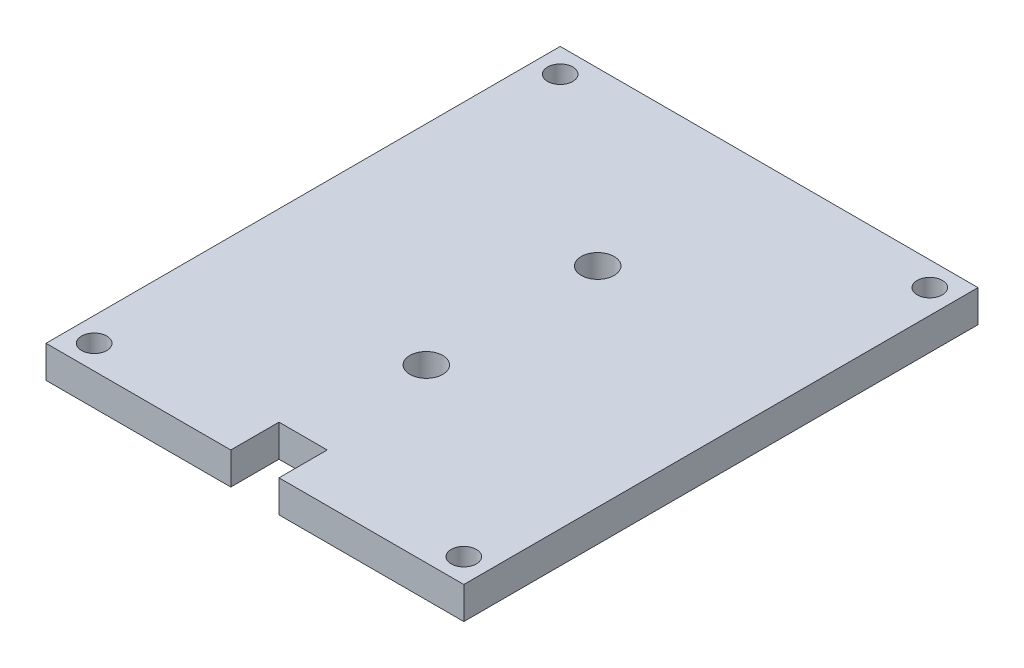
ISO-10303-21;
HEADER;
FILE_DESCRIPTION(('STEP AP214'),'2;1');
FILE_NAME('part.step','',(''),(''),'','','');
FILE_SCHEMA(('AUTOMOTIVE_DESIGN { 1 0 10303 214 1 1 1 1 }'));
ENDSEC;
DATA;
#1=APPLICATION_CONTEXT('core data for automotive mechanical design processes');
#2=APPLICATION_PROTOCOL_DEFINITION('international standard','automotive_design',2000,#1);
#3=PRODUCT_CONTEXT('',#1,'mechanical');
#4=PRODUCT('Part','Part','',(#3));
#5=PRODUCT_RELATED_PRODUCT_CATEGORY('part','',(#4));
#6=PRODUCT_DEFINITION_FORMATION('','',#4);
#7=PRODUCT_DEFINITION_CONTEXT('part definition',#1,'design');
#8=PRODUCT_DEFINITION('design','',#6,#7);
#9=PRODUCT_DEFINITION_SHAPE('','',#8);
#10=(LENGTH_UNIT() NAMED_UNIT(*) SI_UNIT(.MILLI.,.METRE.));
#11=(NAMED_UNIT(*) PLANE_ANGLE_UNIT() SI_UNIT($,.RADIAN.));
#12=(NAMED_UNIT(*) SI_UNIT($,.STERADIAN.) SOLID_ANGLE_UNIT());
#13=UNCERTAINTY_MEASURE_WITH_UNIT(LENGTH_MEASURE(1.E-05),#10,'distance_accuracy_value','');
#14=(GEOMETRIC_REPRESENTATION_CONTEXT(3) GLOBAL_UNCERTAINTY_ASSIGNED_CONTEXT((#13)) GLOBAL_UNIT_ASSIGNED_CONTEXT((#10,
#11,#12)) REPRESENTATION_CONTEXT('',''));
#15=CARTESIAN_POINT('',(0.,0.,0.));
#16=DIRECTION('',(0.,0.,1.));
#17=DIRECTION('',(1.,0.,0.));
#18=AXIS2_PLACEMENT_3D('',#15,#16,#17);
#19=CARTESIAN_POINT('',(0.,6.35,0.));
#20=DIRECTION('',(0.,1.,0.));
#21=DIRECTION('',(0.,0.,1.));
#22=AXIS2_PLACEMENT_3D('',#19,#20,#21);
#23=PLANE('',#22);
#24=CARTESIAN_POINT('',(0.,6.35,-12.1708333333333));
#25=DIRECTION('',(0.,1.,0.));
#26=DIRECTION('',(0.,0.,1.));
#27=AXIS2_PLACEMENT_3D('',#24,#25,#26);
#28=CIRCLE('',#27,3.2512);
#29=CARTESIAN_POINT('',(0.,6.35,-8.91963333333333));
#30=VERTEX_POINT('',#29);
#31=EDGE_CURVE('E200',#30,#30,#28,.T.);
#32=ORIENTED_EDGE('',*,*,#31,.F.);
#33=EDGE_LOOP('',(#32));
#34=FACE_BOUND('',#33,.T.);
#35=CARTESIAN_POINT('',(36.5125,6.35,50.8));
#36=DIRECTION('',(0.,1.,0.));
#37=DIRECTION('',(0.,0.,1.));
#38=AXIS2_PLACEMENT_3D('',#35,#36,#37);
#39=CIRCLE('',#38,2.4892);
#40=CARTESIAN_POINT('',(36.5125,6.35,53.2892));
#41=VERTEX_POINT('',#40);
#42=EDGE_CURVE('E188',#41,#41,#39,.T.);
#43=ORIENTED_EDGE('',*,*,#42,.F.);
#44=EDGE_LOOP('',(#43));
#45=FACE_BOUND('',#44,.T.);
#46=CARTESIAN_POINT('',(36.5125,6.35,-41.275));
#47=DIRECTION('',(0.,1.,0.));
#48=DIRECTION('',(0.,0.,1.));
#49=AXIS2_PLACEMENT_3D('',#46,#47,#48);
#50=CIRCLE('',#49,2.4892);
#51=CARTESIAN_POINT('',(36.5125,6.35,-38.7858));
#52=VERTEX_POINT('',#51);
#53=EDGE_CURVE('E134',#52,#52,#50,.T.);
#54=ORIENTED_EDGE('',*,*,#53,.F.);
#55=EDGE_LOOP('',(#54));
#56=FACE_BOUND('',#55,.T.);
#57=DIRECTION('',(0.,0.,1.));
#58=VECTOR('',#57,1.);
#59=CARTESIAN_POINT('',(-41.275,6.35,-46.0375));
#60=LINE('',#59,#58);
#61=CARTESIAN_POINT('',(-41.275,6.35,-46.0375));
#62=VERTEX_POINT('',#61);
#63=CARTESIAN_POINT('',(-41.275,6.35,55.5625));
#64=VERTEX_POINT('',#63);
#65=EDGE_CURVE('E145',#62,#64,#60,.T.);
#66=ORIENTED_EDGE('',*,*,#65,.T.);
#67=DIRECTION('',(1.,0.,0.));
#68=VECTOR('',#67,1.);
#69=CARTESIAN_POINT('',(-41.275,6.35,55.5625));
#70=LINE('',#69,#68);
#71=CARTESIAN_POINT('',(-4.76249999999999,6.35,55.5625));
#72=VERTEX_POINT('',#71);
#73=EDGE_CURVE('E93',#64,#72,#70,.T.);
#74=ORIENTED_EDGE('',*,*,#73,.T.);
#75=DIRECTION('',(0.,0.,-1.));
#76=VECTOR('',#75,1.);
#77=CARTESIAN_POINT('',(-4.76249999999999,6.35,55.5625));
#78=LINE('',#77,#76);
#79=CARTESIAN_POINT('',(-4.76249999999999,6.35,46.0375));
#80=VERTEX_POINT('',#79);
#81=EDGE_CURVE('E160',#72,#80,#78,.T.);
#82=ORIENTED_EDGE('',*,*,#81,.T.);
#83=DIRECTION('',(1.,0.,0.));
#84=VECTOR('',#83,1.);
#85=CARTESIAN_POINT('',(-4.76249999999999,6.35,46.0375));
#86=LINE('',#85,#84);
#87=CARTESIAN_POINT('',(4.76250000000001,6.35,46.0375));
#88=VERTEX_POINT('',#87);
#89=EDGE_CURVE('E173',#80,#88,#86,.T.);
#90=ORIENTED_EDGE('',*,*,#89,.T.);
#91=DIRECTION('',(0.,0.,1.));
#92=VECTOR('',#91,1.);
#93=CARTESIAN_POINT('',(4.76250000000002,6.35,55.5625));
#94=LINE('',#93,#92);
#95=CARTESIAN_POINT('',(4.76250000000002,6.35,55.5625));
#96=VERTEX_POINT('',#95);
#97=EDGE_CURVE('E112',#88,#96,#94,.T.);
#98=ORIENTED_EDGE('',*,*,#97,.T.);
#99=DIRECTION('',(1.,0.,0.));
#100=VECTOR('',#99,1.);
#101=CARTESIAN_POINT('',(4.76250000000002,6.35,55.5625));
#102=LINE('',#101,#100);
#103=CARTESIAN_POINT('',(41.275,6.35,55.5625));
#104=VERTEX_POINT('',#103);
#105=EDGE_CURVE('E106',#96,#104,#102,.T.);
#106=ORIENTED_EDGE('',*,*,#105,.T.);
#107=DIRECTION('',(0.,0.,-1.));
#108=VECTOR('',#107,1.);
#109=CARTESIAN_POINT('',(41.275,6.35,-46.0375));
#110=LINE('',#109,#108);
#111=CARTESIAN_POINT('',(41.275,6.35,-46.0375));
#112=VERTEX_POINT('',#111);
#113=EDGE_CURVE('E110',#104,#112,#110,.T.);
#114=ORIENTED_EDGE('',*,*,#113,.T.);
#115=DIRECTION('',(-1.,0.,0.));
#116=VECTOR('',#115,1.);
#117=CARTESIAN_POINT('',(-41.275,6.35,-46.0375));
#118=LINE('',#117,#116);
#119=EDGE_CURVE('E50',#112,#62,#118,.T.);
#120=ORIENTED_EDGE('',*,*,#119,.T.);
#121=EDGE_LOOP('',(#66,#74,#82,#90,#98,#106,#114,#120));
#122=FACE_BOUND('',#121,.T.);
#123=CARTESIAN_POINT('',(-36.5125,6.35,-41.275));
#124=DIRECTION('',(0.,1.,0.));
#125=DIRECTION('',(0.,0.,1.));
#126=AXIS2_PLACEMENT_3D('',#123,#124,#125);
#127=CIRCLE('',#126,2.4892);
#128=CARTESIAN_POINT('',(-36.5125,6.35,-38.7858));
#129=VERTEX_POINT('',#128);
#130=EDGE_CURVE('E182',#129,#129,#127,.T.);
#131=ORIENTED_EDGE('',*,*,#130,.F.);
#132=EDGE_LOOP('',(#131));
#133=FACE_BOUND('',#132,.T.);
#134=CARTESIAN_POINT('',(-36.5125,6.35,50.8));
#135=DIRECTION('',(0.,1.,0.));
#136=DIRECTION('',(0.,0.,1.));
#137=AXIS2_PLACEMENT_3D('',#134,#135,#136);
#138=CIRCLE('',#137,2.4892);
#139=CARTESIAN_POINT('',(-36.5125,6.35,53.2892));
#140=VERTEX_POINT('',#139);
#141=EDGE_CURVE('E194',#140,#140,#138,.T.);
#142=ORIENTED_EDGE('',*,*,#141,.F.);
#143=EDGE_LOOP('',(#142));
#144=FACE_BOUND('',#143,.T.);
#145=CARTESIAN_POINT('',(0.,6.35,21.6958333333333));
#146=DIRECTION('',(0.,1.,0.));
#147=DIRECTION('',(0.,0.,1.));
#148=AXIS2_PLACEMENT_3D('',#145,#146,#147);
#149=CIRCLE('',#148,3.2512);
#150=CARTESIAN_POINT('',(0.,6.35,24.9470333333333));
#151=VERTEX_POINT('',#150);
#152=EDGE_CURVE('E206',#151,#151,#149,.T.);
#153=ORIENTED_EDGE('',*,*,#152,.F.);
#154=EDGE_LOOP('',(#153));
#155=FACE_BOUND('',#154,.T.);
#156=ADVANCED_FACE('F33',(#34,#45,#56,#122,#133,#144,#155),#23,.T.);
#157=CARTESIAN_POINT('',(0.,0.,0.));
#158=DIRECTION('',(0.,1.,0.));
#159=DIRECTION('',(0.,0.,1.));
#160=AXIS2_PLACEMENT_3D('',#157,#158,#159);
#161=PLANE('',#160);
#162=DIRECTION('',(0.,0.,1.));
#163=VECTOR('',#162,1.);
#164=CARTESIAN_POINT('',(-41.275,0.,-46.0375));
#165=LINE('',#164,#163);
#166=CARTESIAN_POINT('',(-41.275,0.,-46.0375));
#167=VERTEX_POINT('',#166);
#168=CARTESIAN_POINT('',(-41.275,0.,55.5625));
#169=VERTEX_POINT('',#168);
#170=EDGE_CURVE('E130',#167,#169,#165,.T.);
#171=ORIENTED_EDGE('',*,*,#170,.F.);
#172=DIRECTION('',(-1.,0.,0.));
#173=VECTOR('',#172,1.);
#174=CARTESIAN_POINT('',(-41.275,0.,-46.0375));
#175=LINE('',#174,#173);
#176=CARTESIAN_POINT('',(41.275,0.,-46.0375));
#177=VERTEX_POINT('',#176);
#178=EDGE_CURVE('E85',#177,#167,#175,.T.);
#179=ORIENTED_EDGE('',*,*,#178,.F.);
#180=DIRECTION('',(0.,0.,-1.));
#181=VECTOR('',#180,1.);
#182=CARTESIAN_POINT('',(41.275,0.,-46.0375));
#183=LINE('',#182,#181);
#184=CARTESIAN_POINT('',(41.275,0.,55.5625));
#185=VERTEX_POINT('',#184);
#186=EDGE_CURVE('E79',#185,#177,#183,.T.);
#187=ORIENTED_EDGE('',*,*,#186,.F.);
#188=DIRECTION('',(1.,0.,0.));
#189=VECTOR('',#188,1.);
#190=CARTESIAN_POINT('',(4.76250000000002,0.,55.5625));
#191=LINE('',#190,#189);
#192=CARTESIAN_POINT('',(4.76250000000002,0.,55.5625));
#193=VERTEX_POINT('',#192);
#194=EDGE_CURVE('E120',#193,#185,#191,.T.);
#195=ORIENTED_EDGE('',*,*,#194,.F.);
#196=DIRECTION('',(0.,0.,1.));
#197=VECTOR('',#196,1.);
#198=CARTESIAN_POINT('',(4.76250000000002,0.,55.5625));
#199=LINE('',#198,#197);
#200=CARTESIAN_POINT('',(4.76250000000001,0.,46.0375));
#201=VERTEX_POINT('',#200);
#202=EDGE_CURVE('E140',#201,#193,#199,.T.);
#203=ORIENTED_EDGE('',*,*,#202,.F.);
#204=DIRECTION('',(1.,0.,0.));
#205=VECTOR('',#204,1.);
#206=CARTESIAN_POINT('',(-4.76249999999999,0.,46.0375));
#207=LINE('',#206,#205);
#208=CARTESIAN_POINT('',(-4.76249999999999,0.,46.0375));
#209=VERTEX_POINT('',#208);
#210=EDGE_CURVE('E138',#209,#201,#207,.T.);
#211=ORIENTED_EDGE('',*,*,#210,.F.);
#212=DIRECTION('',(0.,0.,-1.));
#213=VECTOR('',#212,1.);
#214=CARTESIAN_POINT('',(-4.76249999999999,0.,55.5625));
#215=LINE('',#214,#213);
#216=CARTESIAN_POINT('',(-4.76249999999999,0.,55.5625));
#217=VERTEX_POINT('',#216);
#218=EDGE_CURVE('E136',#217,#209,#215,.T.);
#219=ORIENTED_EDGE('',*,*,#218,.F.);
#220=DIRECTION('',(1.,0.,0.));
#221=VECTOR('',#220,1.);
#222=CARTESIAN_POINT('',(-41.275,0.,55.5625));
#223=LINE('',#222,#221);
#224=EDGE_CURVE('E133',#169,#217,#223,.T.);
#225=ORIENTED_EDGE('',*,*,#224,.F.);
#226=EDGE_LOOP('',(#171,#179,#187,#195,#203,#211,#219,#225));
#227=FACE_BOUND('',#226,.T.);
#228=CARTESIAN_POINT('',(36.5125,0.,-41.275));
#229=DIRECTION('',(0.,1.,0.));
#230=DIRECTION('',(0.,0.,1.));
#231=AXIS2_PLACEMENT_3D('',#228,#229,#230);
#232=CIRCLE('',#231,2.4892);
#233=CARTESIAN_POINT('',(36.5125,0.,-38.7858));
#234=VERTEX_POINT('',#233);
#235=EDGE_CURVE('E179',#234,#234,#232,.T.);
#236=ORIENTED_EDGE('',*,*,#235,.T.);
#237=EDGE_LOOP('',(#236));
#238=FACE_BOUND('',#237,.T.);
#239=CARTESIAN_POINT('',(-36.5125,0.,-41.275));
#240=DIRECTION('',(0.,1.,0.));
#241=DIRECTION('',(0.,0.,1.));
#242=AXIS2_PLACEMENT_3D('',#239,#240,#241);
#243=CIRCLE('',#242,2.4892);
#244=CARTESIAN_POINT('',(-36.5125,0.,-38.7858));
#245=VERTEX_POINT('',#244);
#246=EDGE_CURVE('E185',#245,#245,#243,.T.);
#247=ORIENTED_EDGE('',*,*,#246,.T.);
#248=EDGE_LOOP('',(#247));
#249=FACE_BOUND('',#248,.T.);
#250=CARTESIAN_POINT('',(36.5125,0.,50.8));
#251=DIRECTION('',(0.,1.,0.));
#252=DIRECTION('',(0.,0.,1.));
#253=AXIS2_PLACEMENT_3D('',#250,#251,#252);
#254=CIRCLE('',#253,2.4892);
#255=CARTESIAN_POINT('',(36.5125,0.,53.2892));
#256=VERTEX_POINT('',#255);
#257=EDGE_CURVE('E191',#256,#256,#254,.T.);
#258=ORIENTED_EDGE('',*,*,#257,.T.);
#259=EDGE_LOOP('',(#258));
#260=FACE_BOUND('',#259,.T.);
#261=CARTESIAN_POINT('',(-36.5125,0.,50.8));
#262=DIRECTION('',(0.,1.,0.));
#263=DIRECTION('',(0.,0.,1.));
#264=AXIS2_PLACEMENT_3D('',#261,#262,#263);
#265=CIRCLE('',#264,2.4892);
#266=CARTESIAN_POINT('',(-36.5125,0.,53.2892));
#267=VERTEX_POINT('',#266);
#268=EDGE_CURVE('E197',#267,#267,#265,.T.);
#269=ORIENTED_EDGE('',*,*,#268,.T.);
#270=EDGE_LOOP('',(#269));
#271=FACE_BOUND('',#270,.T.);
#272=CARTESIAN_POINT('',(0.,0.,-12.1708333333333));
#273=DIRECTION('',(0.,1.,0.));
#274=DIRECTION('',(0.,0.,1.));
#275=AXIS2_PLACEMENT_3D('',#272,#273,#274);
#276=CIRCLE('',#275,3.2512);
#277=CARTESIAN_POINT('',(0.,0.,-8.91963333333333));
#278=VERTEX_POINT('',#277);
#279=EDGE_CURVE('E203',#278,#278,#276,.T.);
#280=ORIENTED_EDGE('',*,*,#279,.T.);
#281=EDGE_LOOP('',(#280));
#282=FACE_BOUND('',#281,.T.);
#283=CARTESIAN_POINT('',(0.,0.,21.6958333333333));
#284=DIRECTION('',(0.,1.,0.));
#285=DIRECTION('',(0.,0.,1.));
#286=AXIS2_PLACEMENT_3D('',#283,#284,#285);
#287=CIRCLE('',#286,3.2512);
#288=CARTESIAN_POINT('',(0.,0.,24.9470333333333));
#289=VERTEX_POINT('',#288);
#290=EDGE_CURVE('E209',#289,#289,#287,.T.);
#291=ORIENTED_EDGE('',*,*,#290,.T.);
#292=EDGE_LOOP('',(#291));
#293=FACE_BOUND('',#292,.T.);
#294=ADVANCED_FACE('F164',(#227,#238,#249,#260,#271,#282,#293),#161,.F.);
#295=CARTESIAN_POINT('',(-41.275,6.35,-46.0375));
#296=DIRECTION('',(1.,0.,0.));
#297=DIRECTION('',(0.,0.,-1.));
#298=AXIS2_PLACEMENT_3D('',#295,#296,#297);
#299=PLANE('',#298);
#300=ORIENTED_EDGE('',*,*,#170,.T.);
#301=DIRECTION('',(0.,-1.,0.));
#302=VECTOR('',#301,1.);
#303=CARTESIAN_POINT('',(-41.275,6.35,55.5625));
#304=LINE('',#303,#302);
#305=EDGE_CURVE('E11',#64,#169,#304,.T.);
#306=ORIENTED_EDGE('',*,*,#305,.F.);
#307=ORIENTED_EDGE('',*,*,#65,.F.);
#308=DIRECTION('',(0.,-1.,0.));
#309=VECTOR('',#308,1.);
#310=CARTESIAN_POINT('',(-41.275,6.35,-46.0375));
#311=LINE('',#310,#309);
#312=EDGE_CURVE('E126',#62,#167,#311,.T.);
#313=ORIENTED_EDGE('',*,*,#312,.T.);
#314=EDGE_LOOP('',(#300,#306,#307,#313));
#315=FACE_BOUND('',#314,.T.);
#316=ADVANCED_FACE('F35',(#315),#299,.F.);
#317=CARTESIAN_POINT('',(-41.275,6.35,55.5625));
#318=DIRECTION('',(0.,0.,-1.));
#319=DIRECTION('',(-1.,0.,0.));
#320=AXIS2_PLACEMENT_3D('',#317,#318,#319);
#321=PLANE('',#320);
#322=ORIENTED_EDGE('',*,*,#224,.T.);
#323=DIRECTION('',(0.,-1.,0.));
#324=VECTOR('',#323,1.);
#325=CARTESIAN_POINT('',(-4.76249999999999,6.35,55.5625));
#326=LINE('',#325,#324);
#327=EDGE_CURVE('E42',#72,#217,#326,.T.);
#328=ORIENTED_EDGE('',*,*,#327,.F.);
#329=ORIENTED_EDGE('',*,*,#73,.F.);
#330=ORIENTED_EDGE('',*,*,#305,.T.);
#331=EDGE_LOOP('',(#322,#328,#329,#330));
#332=FACE_BOUND('',#331,.T.);
#333=ADVANCED_FACE('F243',(#332),#321,.F.);
#334=CARTESIAN_POINT('',(-4.76249999999999,6.35,55.5625));
#335=DIRECTION('',(-1.,0.,0.));
#336=DIRECTION('',(0.,0.,1.));
#337=AXIS2_PLACEMENT_3D('',#334,#335,#336);
#338=PLANE('',#337);
#339=ORIENTED_EDGE('',*,*,#218,.T.);
#340=DIRECTION('',(0.,-1.,0.));
#341=VECTOR('',#340,1.);
#342=CARTESIAN_POINT('',(-4.76249999999999,6.35,46.0375));
#343=LINE('',#342,#341);
#344=EDGE_CURVE('E152',#80,#209,#343,.T.);
#345=ORIENTED_EDGE('',*,*,#344,.F.);
#346=ORIENTED_EDGE('',*,*,#81,.F.);
#347=ORIENTED_EDGE('',*,*,#327,.T.);
#348=EDGE_LOOP('',(#339,#345,#346,#347));
#349=FACE_BOUND('',#348,.T.);
#350=ADVANCED_FACE('F158',(#349),#338,.F.);
#351=CARTESIAN_POINT('',(-4.76249999999999,6.35,46.0375));
#352=DIRECTION('',(0.,0.,-1.));
#353=DIRECTION('',(-1.,0.,0.));
#354=AXIS2_PLACEMENT_3D('',#351,#352,#353);
#355=PLANE('',#354);
#356=ORIENTED_EDGE('',*,*,#210,.T.);
#357=DIRECTION('',(0.,-1.,0.));
#358=VECTOR('',#357,1.);
#359=CARTESIAN_POINT('',(4.76250000000001,6.35,46.0375));
#360=LINE('',#359,#358);
#361=EDGE_CURVE('E149',#88,#201,#360,.T.);
#362=ORIENTED_EDGE('',*,*,#361,.F.);
#363=ORIENTED_EDGE('',*,*,#89,.F.);
#364=ORIENTED_EDGE('',*,*,#344,.T.);
#365=EDGE_LOOP('',(#356,#362,#363,#364));
#366=FACE_BOUND('',#365,.T.);
#367=ADVANCED_FACE('F169',(#366),#355,.F.);
#368=CARTESIAN_POINT('',(4.76250000000002,6.35,55.5625));
#369=DIRECTION('',(1.,0.,0.));
#370=DIRECTION('',(0.,0.,-1.));
#371=AXIS2_PLACEMENT_3D('',#368,#369,#370);
#372=PLANE('',#371);
#373=ORIENTED_EDGE('',*,*,#202,.T.);
#374=DIRECTION('',(0.,-1.,0.));
#375=VECTOR('',#374,1.);
#376=CARTESIAN_POINT('',(4.76250000000002,6.35,55.5625));
#377=LINE('',#376,#375);
#378=EDGE_CURVE('E121',#96,#193,#377,.T.);
#379=ORIENTED_EDGE('',*,*,#378,.F.);
#380=ORIENTED_EDGE('',*,*,#97,.F.);
#381=ORIENTED_EDGE('',*,*,#361,.T.);
#382=EDGE_LOOP('',(#373,#379,#380,#381));
#383=FACE_BOUND('',#382,.T.);
#384=ADVANCED_FACE('F172',(#383),#372,.F.);
#385=CARTESIAN_POINT('',(4.76250000000002,6.35,55.5625));
#386=DIRECTION('',(0.,0.,-1.));
#387=DIRECTION('',(-1.,0.,0.));
#388=AXIS2_PLACEMENT_3D('',#385,#386,#387);
#389=PLANE('',#388);
#390=ORIENTED_EDGE('',*,*,#194,.T.);
#391=DIRECTION('',(0.,-1.,0.));
#392=VECTOR('',#391,1.);
#393=CARTESIAN_POINT('',(41.275,6.35,55.5625));
#394=LINE('',#393,#392);
#395=EDGE_CURVE('E117',#104,#185,#394,.T.);
#396=ORIENTED_EDGE('',*,*,#395,.F.);
#397=ORIENTED_EDGE('',*,*,#105,.F.);
#398=ORIENTED_EDGE('',*,*,#378,.T.);
#399=EDGE_LOOP('',(#390,#396,#397,#398));
#400=FACE_BOUND('',#399,.T.);
#401=ADVANCED_FACE('F118',(#400),#389,.F.);
#402=CARTESIAN_POINT('',(41.275,6.35,-46.0375));
#403=DIRECTION('',(-1.,0.,0.));
#404=DIRECTION('',(0.,0.,1.));
#405=AXIS2_PLACEMENT_3D('',#402,#403,#404);
#406=PLANE('',#405);
#407=ORIENTED_EDGE('',*,*,#186,.T.);
#408=DIRECTION('',(0.,-1.,0.));
#409=VECTOR('',#408,1.);
#410=CARTESIAN_POINT('',(41.275,6.35,-46.0375));
#411=LINE('',#410,#409);
#412=EDGE_CURVE('E122',#112,#177,#411,.T.);
#413=ORIENTED_EDGE('',*,*,#412,.F.);
#414=ORIENTED_EDGE('',*,*,#113,.F.);
#415=ORIENTED_EDGE('',*,*,#395,.T.);
#416=EDGE_LOOP('',(#407,#413,#414,#415));
#417=FACE_BOUND('',#416,.T.);
#418=ADVANCED_FACE('F124',(#417),#406,.F.);
#419=CARTESIAN_POINT('',(-41.275,6.35,-46.0375));
#420=DIRECTION('',(0.,0.,1.));
#421=DIRECTION('',(1.,0.,0.));
#422=AXIS2_PLACEMENT_3D('',#419,#420,#421);
#423=PLANE('',#422);
#424=ORIENTED_EDGE('',*,*,#178,.T.);
#425=ORIENTED_EDGE('',*,*,#312,.F.);
#426=ORIENTED_EDGE('',*,*,#119,.F.);
#427=ORIENTED_EDGE('',*,*,#412,.T.);
#428=EDGE_LOOP('',(#424,#425,#426,#427));
#429=FACE_BOUND('',#428,.T.);
#430=ADVANCED_FACE('F231',(#429),#423,.F.);
#431=CARTESIAN_POINT('',(36.5125,6.35,-41.275));
#432=DIRECTION('',(0.,-1.,0.));
#433=DIRECTION('',(0.,0.,-1.));
#434=AXIS2_PLACEMENT_3D('',#431,#432,#433);
#435=CYLINDRICAL_SURFACE('',#434,2.4892);
#436=ORIENTED_EDGE('',*,*,#53,.T.);
#437=EDGE_LOOP('',(#436));
#438=FACE_BOUND('',#437,.T.);
#439=ORIENTED_EDGE('',*,*,#235,.F.);
#440=EDGE_LOOP('',(#439));
#441=FACE_BOUND('',#440,.T.);
#442=ADVANCED_FACE('F228',(#438,#441),#435,.F.);
#443=CARTESIAN_POINT('',(-36.5125,6.35,-41.275));
#444=DIRECTION('',(0.,-1.,0.));
#445=DIRECTION('',(0.,0.,-1.));
#446=AXIS2_PLACEMENT_3D('',#443,#444,#445);
#447=CYLINDRICAL_SURFACE('',#446,2.4892);
#448=ORIENTED_EDGE('',*,*,#130,.T.);
#449=EDGE_LOOP('',(#448));
#450=FACE_BOUND('',#449,.T.);
#451=ORIENTED_EDGE('',*,*,#246,.F.);
#452=EDGE_LOOP('',(#451));
#453=FACE_BOUND('',#452,.T.);
#454=ADVANCED_FACE('F307',(#450,#453),#447,.F.);
#455=CARTESIAN_POINT('',(36.5125,6.35,50.8));
#456=DIRECTION('',(0.,-1.,0.));
#457=DIRECTION('',(0.,0.,-1.));
#458=AXIS2_PLACEMENT_3D('',#455,#456,#457);
#459=CYLINDRICAL_SURFACE('',#458,2.4892);
#460=ORIENTED_EDGE('',*,*,#42,.T.);
#461=EDGE_LOOP('',(#460));
#462=FACE_BOUND('',#461,.T.);
#463=ORIENTED_EDGE('',*,*,#257,.F.);
#464=EDGE_LOOP('',(#463));
#465=FACE_BOUND('',#464,.T.);
#466=ADVANCED_FACE('F315',(#462,#465),#459,.F.);
#467=CARTESIAN_POINT('',(-36.5125,6.35,50.8));
#468=DIRECTION('',(0.,-1.,0.));
#469=DIRECTION('',(0.,0.,-1.));
#470=AXIS2_PLACEMENT_3D('',#467,#468,#469);
#471=CYLINDRICAL_SURFACE('',#470,2.4892);
#472=ORIENTED_EDGE('',*,*,#141,.T.);
#473=EDGE_LOOP('',(#472));
#474=FACE_BOUND('',#473,.T.);
#475=ORIENTED_EDGE('',*,*,#268,.F.);
#476=EDGE_LOOP('',(#475));
#477=FACE_BOUND('',#476,.T.);
#478=ADVANCED_FACE('F323',(#474,#477),#471,.F.);
#479=CARTESIAN_POINT('',(0.,6.35,-12.1708333333333));
#480=DIRECTION('',(0.,-1.,0.));
#481=DIRECTION('',(0.,0.,-1.));
#482=AXIS2_PLACEMENT_3D('',#479,#480,#481);
#483=CYLINDRICAL_SURFACE('',#482,3.2512);
#484=ORIENTED_EDGE('',*,*,#31,.T.);
#485=EDGE_LOOP('',(#484));
#486=FACE_BOUND('',#485,.T.);
#487=ORIENTED_EDGE('',*,*,#279,.F.);
#488=EDGE_LOOP('',(#487));
#489=FACE_BOUND('',#488,.T.);
#490=ADVANCED_FACE('F332',(#486,#489),#483,.F.);
#491=CARTESIAN_POINT('',(0.,6.35,21.6958333333333));
#492=DIRECTION('',(0.,-1.,0.));
#493=DIRECTION('',(0.,0.,-1.));
#494=AXIS2_PLACEMENT_3D('',#491,#492,#493);
#495=CYLINDRICAL_SURFACE('',#494,3.2512);
#496=ORIENTED_EDGE('',*,*,#152,.T.);
#497=EDGE_LOOP('',(#496));
#498=FACE_BOUND('',#497,.T.);
#499=ORIENTED_EDGE('',*,*,#290,.F.);
#500=EDGE_LOOP('',(#499));
#501=FACE_BOUND('',#500,.T.);
#502=ADVANCED_FACE('F215',(#498,#501),#495,.F.);
#503=CLOSED_SHELL('',(#156,#294,#316,#333,#350,#367,#384,#401,#418,#430,#442,#454,#466,#478,
#490,#502));
#504=MANIFOLD_SOLID_BREP('B2',#503);
#505=ADVANCED_BREP_SHAPE_REPRESENTATION('',(#18,#504),#14);
#506=SHAPE_DEFINITION_REPRESENTATION(#9,#505);
ENDSEC;
END-ISO-10303-21;
